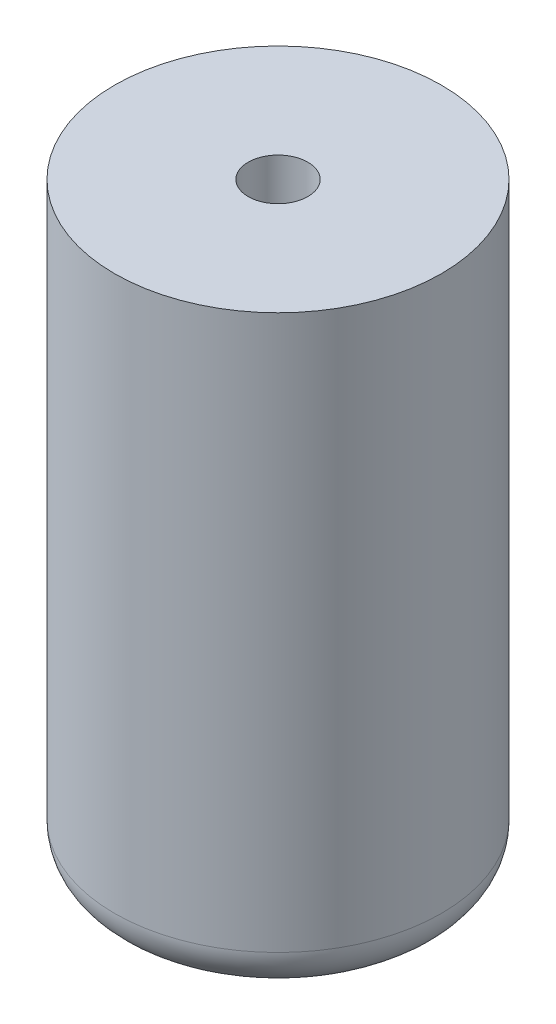
ISO-10303-21;
HEADER;
FILE_DESCRIPTION(('STEP AP214'),'2;1');
FILE_NAME('part.step','',(''),(''),'','','');
FILE_SCHEMA(('AUTOMOTIVE_DESIGN { 1 0 10303 214 1 1 1 1 }'));
ENDSEC;
DATA;
#1=APPLICATION_CONTEXT('core data for automotive mechanical design processes');
#2=APPLICATION_PROTOCOL_DEFINITION('international standard','automotive_design',2000,#1);
#3=PRODUCT_CONTEXT('',#1,'mechanical');
#4=PRODUCT('Part','Part','',(#3));
#5=PRODUCT_RELATED_PRODUCT_CATEGORY('part','',(#4));
#6=PRODUCT_DEFINITION_FORMATION('','',#4);
#7=PRODUCT_DEFINITION_CONTEXT('part definition',#1,'design');
#8=PRODUCT_DEFINITION('design','',#6,#7);
#9=PRODUCT_DEFINITION_SHAPE('','',#8);
#10=(LENGTH_UNIT() NAMED_UNIT(*) SI_UNIT(.MILLI.,.METRE.));
#11=(NAMED_UNIT(*) PLANE_ANGLE_UNIT() SI_UNIT($,.RADIAN.));
#12=(NAMED_UNIT(*) SI_UNIT($,.STERADIAN.) SOLID_ANGLE_UNIT());
#13=UNCERTAINTY_MEASURE_WITH_UNIT(LENGTH_MEASURE(1.E-05),#10,'distance_accuracy_value','');
#14=(GEOMETRIC_REPRESENTATION_CONTEXT(3) GLOBAL_UNCERTAINTY_ASSIGNED_CONTEXT((#13)) GLOBAL_UNIT_ASSIGNED_CONTEXT((#10,
#11,#12)) REPRESENTATION_CONTEXT('',''));
#15=CARTESIAN_POINT('',(0.,0.,0.));
#16=DIRECTION('',(0.,0.,1.));
#17=DIRECTION('',(1.,0.,0.));
#18=AXIS2_PLACEMENT_3D('',#15,#16,#17);
#19=CARTESIAN_POINT('',(0.,42.,0.));
#20=DIRECTION('',(0.,-1.,0.));
#21=DIRECTION('',(0.,0.,-1.));
#22=AXIS2_PLACEMENT_3D('',#19,#20,#21);
#23=CYLINDRICAL_SURFACE('',#22,11.5);
#24=CARTESIAN_POINT('',(0.,3.,0.));
#25=DIRECTION('',(0.,1.,0.));
#26=DIRECTION('',(0.,0.,1.));
#27=AXIS2_PLACEMENT_3D('',#24,#25,#26);
#28=CIRCLE('',#27,11.5);
#29=CARTESIAN_POINT('',(0.,3.,11.5));
#30=VERTEX_POINT('',#29);
#31=EDGE_CURVE('E37',#30,#30,#28,.T.);
#32=ORIENTED_EDGE('',*,*,#31,.T.);
#33=EDGE_LOOP('',(#32));
#34=FACE_BOUND('',#33,.T.);
#35=CARTESIAN_POINT('',(0.,42.,0.));
#36=DIRECTION('',(0.,1.,0.));
#37=DIRECTION('',(0.,0.,1.));
#38=AXIS2_PLACEMENT_3D('',#35,#36,#37);
#39=CIRCLE('',#38,11.5);
#40=CARTESIAN_POINT('',(0.,42.,11.5));
#41=VERTEX_POINT('',#40);
#42=EDGE_CURVE('E41',#41,#41,#39,.T.);
#43=ORIENTED_EDGE('',*,*,#42,.F.);
#44=EDGE_LOOP('',(#43));
#45=FACE_BOUND('',#44,.T.);
#46=ADVANCED_FACE('F30',(#34,#45),#23,.T.);
#47=CARTESIAN_POINT('',(0.,42.,0.));
#48=DIRECTION('',(0.,1.,0.));
#49=DIRECTION('',(0.,0.,1.));
#50=AXIS2_PLACEMENT_3D('',#47,#48,#49);
#51=PLANE('',#50);
#52=CARTESIAN_POINT('',(0.,42.,0.));
#53=DIRECTION('',(0.,1.,0.));
#54=DIRECTION('',(0.,0.,1.));
#55=AXIS2_PLACEMENT_3D('',#52,#53,#54);
#56=CIRCLE('',#55,2.1);
#57=CARTESIAN_POINT('',(0.,42.,2.1));
#58=VERTEX_POINT('',#57);
#59=EDGE_CURVE('E48',#58,#58,#56,.T.);
#60=ORIENTED_EDGE('',*,*,#59,.F.);
#61=EDGE_LOOP('',(#60));
#62=FACE_BOUND('',#61,.T.);
#63=ORIENTED_EDGE('',*,*,#42,.T.);
#64=EDGE_LOOP('',(#63));
#65=FACE_BOUND('',#64,.T.);
#66=ADVANCED_FACE('F62',(#62,#65),#51,.T.);
#67=CARTESIAN_POINT('',(0.,0.,0.));
#68=DIRECTION('',(0.,1.,0.));
#69=DIRECTION('',(0.,0.,1.));
#70=AXIS2_PLACEMENT_3D('',#67,#68,#69);
#71=PLANE('',#70);
#72=CARTESIAN_POINT('',(0.,0.,0.));
#73=DIRECTION('',(0.,1.,0.));
#74=DIRECTION('',(0.,0.,1.));
#75=AXIS2_PLACEMENT_3D('',#72,#73,#74);
#76=CIRCLE('',#75,8.5);
#77=CARTESIAN_POINT('',(0.,0.,8.5));
#78=VERTEX_POINT('',#77);
#79=EDGE_CURVE('E10',#78,#78,#76,.F.);
#80=ORIENTED_EDGE('',*,*,#79,.T.);
#81=EDGE_LOOP('',(#80));
#82=FACE_BOUND('',#81,.T.);
#83=ADVANCED_FACE('F65',(#82),#71,.F.);
#84=CARTESIAN_POINT('',(0.,3.,0.));
#85=DIRECTION('',(0.,1.,0.));
#86=DIRECTION('',(0.,0.,1.));
#87=AXIS2_PLACEMENT_3D('',#84,#85,#86);
#88=TOROIDAL_SURFACE('',#87,8.5,3.);
#89=ORIENTED_EDGE('',*,*,#79,.F.);
#90=EDGE_LOOP('',(#89));
#91=FACE_BOUND('',#90,.T.);
#92=ORIENTED_EDGE('',*,*,#31,.F.);
#93=EDGE_LOOP('',(#92));
#94=FACE_BOUND('',#93,.T.);
#95=ADVANCED_FACE('F32',(#91,#94),#88,.T.);
#96=CARTESIAN_POINT('',(0.,32.,0.));
#97=DIRECTION('',(0.,1.,0.));
#98=DIRECTION('',(0.,0.,1.));
#99=AXIS2_PLACEMENT_3D('',#96,#97,#98);
#100=CYLINDRICAL_SURFACE('',#99,2.1);
#101=CARTESIAN_POINT('',(0.,32.,0.));
#102=DIRECTION('',(0.,1.,0.));
#103=DIRECTION('',(0.,0.,1.));
#104=AXIS2_PLACEMENT_3D('',#101,#102,#103);
#105=CIRCLE('',#104,2.1);
#106=CARTESIAN_POINT('',(0.,32.,2.1));
#107=VERTEX_POINT('',#106);
#108=EDGE_CURVE('E45',#107,#107,#105,.T.);
#109=ORIENTED_EDGE('',*,*,#108,.F.);
#110=EDGE_LOOP('',(#109));
#111=FACE_BOUND('',#110,.T.);
#112=ORIENTED_EDGE('',*,*,#59,.T.);
#113=EDGE_LOOP('',(#112));
#114=FACE_BOUND('',#113,.T.);
#115=ADVANCED_FACE('F56',(#111,#114),#100,.F.);
#116=CARTESIAN_POINT('',(0.,32.,0.));
#117=DIRECTION('',(0.,1.,0.));
#118=DIRECTION('',(0.,0.,1.));
#119=AXIS2_PLACEMENT_3D('',#116,#117,#118);
#120=PLANE('',#119);
#121=ORIENTED_EDGE('',*,*,#108,.T.);
#122=EDGE_LOOP('',(#121));
#123=FACE_BOUND('',#122,.T.);
#124=ADVANCED_FACE('F54',(#123),#120,.T.);
#125=CLOSED_SHELL('',(#46,#66,#83,#95,#115,#124));
#126=MANIFOLD_SOLID_BREP('B2',#125);
#127=ADVANCED_BREP_SHAPE_REPRESENTATION('',(#18,#126),#14);
#128=SHAPE_DEFINITION_REPRESENTATION(#9,#127);
ENDSEC;
END-ISO-10303-21;
